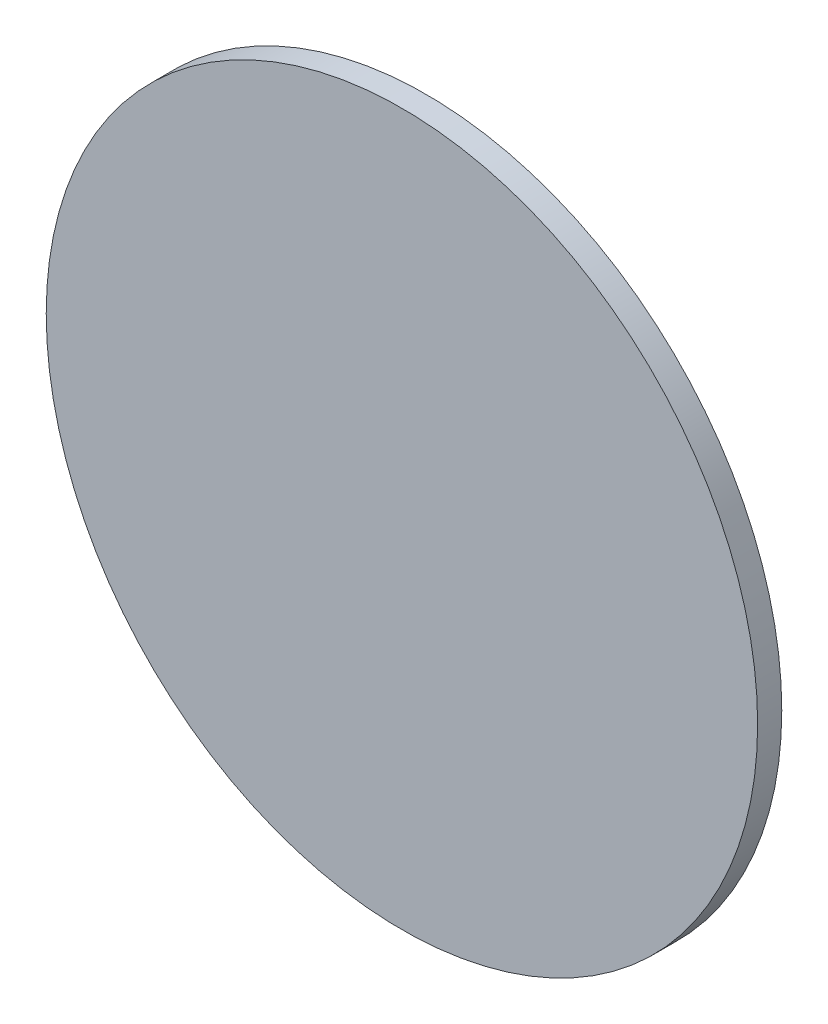
ISO-10303-21;
HEADER;
FILE_DESCRIPTION(('STEP AP214'),'2;1');
FILE_NAME('part.step','',(''),(''),'','','');
FILE_SCHEMA(('AUTOMOTIVE_DESIGN { 1 0 10303 214 1 1 1 1 }'));
ENDSEC;
DATA;
#1=APPLICATION_CONTEXT('core data for automotive mechanical design processes');
#2=APPLICATION_PROTOCOL_DEFINITION('international standard','automotive_design',2000,#1);
#3=PRODUCT_CONTEXT('',#1,'mechanical');
#4=PRODUCT('Part','Part','',(#3));
#5=PRODUCT_RELATED_PRODUCT_CATEGORY('part','',(#4));
#6=PRODUCT_DEFINITION_FORMATION('','',#4);
#7=PRODUCT_DEFINITION_CONTEXT('part definition',#1,'design');
#8=PRODUCT_DEFINITION('design','',#6,#7);
#9=PRODUCT_DEFINITION_SHAPE('','',#8);
#10=(LENGTH_UNIT() NAMED_UNIT(*) SI_UNIT(.MILLI.,.METRE.));
#11=(NAMED_UNIT(*) PLANE_ANGLE_UNIT() SI_UNIT($,.RADIAN.));
#12=(NAMED_UNIT(*) SI_UNIT($,.STERADIAN.) SOLID_ANGLE_UNIT());
#13=UNCERTAINTY_MEASURE_WITH_UNIT(LENGTH_MEASURE(1.E-05),#10,'distance_accuracy_value','');
#14=(GEOMETRIC_REPRESENTATION_CONTEXT(3) GLOBAL_UNCERTAINTY_ASSIGNED_CONTEXT((#13)) GLOBAL_UNIT_ASSIGNED_CONTEXT((#10,
#11,#12)) REPRESENTATION_CONTEXT('',''));
#15=CARTESIAN_POINT('',(0.,0.,0.));
#16=DIRECTION('',(0.,0.,1.));
#17=DIRECTION('',(1.,0.,0.));
#18=AXIS2_PLACEMENT_3D('',#15,#16,#17);
#19=CARTESIAN_POINT('',(0.,0.,10.));
#20=DIRECTION('',(0.,0.,-1.));
#21=DIRECTION('',(-1.,0.,0.));
#22=AXIS2_PLACEMENT_3D('',#19,#20,#21);
#23=CYLINDRICAL_SURFACE('',#22,147.418002466772);
#24=CARTESIAN_POINT('',(0.,0.,10.));
#25=DIRECTION('',(0.,0.,1.));
#26=DIRECTION('',(1.,0.,0.));
#27=AXIS2_PLACEMENT_3D('',#24,#25,#26);
#28=CIRCLE('',#27,147.418002466772);
#29=CARTESIAN_POINT('',(147.418002466772,0.,10.));
#30=VERTEX_POINT('',#29);
#31=EDGE_CURVE('E10',#30,#30,#28,.T.);
#32=ORIENTED_EDGE('',*,*,#31,.F.);
#33=EDGE_LOOP('',(#32));
#34=FACE_BOUND('',#33,.T.);
#35=CARTESIAN_POINT('',(0.,0.,0.));
#36=DIRECTION('',(0.,0.,1.));
#37=DIRECTION('',(1.,0.,0.));
#38=AXIS2_PLACEMENT_3D('',#35,#36,#37);
#39=CIRCLE('',#38,147.418002466772);
#40=CARTESIAN_POINT('',(147.418002466772,0.,0.));
#41=VERTEX_POINT('',#40);
#42=EDGE_CURVE('E34',#41,#41,#39,.T.);
#43=ORIENTED_EDGE('',*,*,#42,.T.);
#44=EDGE_LOOP('',(#43));
#45=FACE_BOUND('',#44,.T.);
#46=ADVANCED_FACE('F31',(#34,#45),#23,.T.);
#47=CARTESIAN_POINT('',(0.,0.,10.));
#48=DIRECTION('',(0.,0.,1.));
#49=DIRECTION('',(1.,0.,0.));
#50=AXIS2_PLACEMENT_3D('',#47,#48,#49);
#51=PLANE('',#50);
#52=ORIENTED_EDGE('',*,*,#31,.T.);
#53=EDGE_LOOP('',(#52));
#54=FACE_BOUND('',#53,.T.);
#55=ADVANCED_FACE('F46',(#54),#51,.T.);
#56=CARTESIAN_POINT('',(0.,0.,0.));
#57=DIRECTION('',(0.,0.,1.));
#58=DIRECTION('',(1.,0.,0.));
#59=AXIS2_PLACEMENT_3D('',#56,#57,#58);
#60=PLANE('',#59);
#61=ORIENTED_EDGE('',*,*,#42,.F.);
#62=EDGE_LOOP('',(#61));
#63=FACE_BOUND('',#62,.T.);
#64=ADVANCED_FACE('F44',(#63),#60,.F.);
#65=CLOSED_SHELL('',(#46,#55,#64));
#66=MANIFOLD_SOLID_BREP('B2',#65);
#67=ADVANCED_BREP_SHAPE_REPRESENTATION('',(#18,#66),#14);
#68=SHAPE_DEFINITION_REPRESENTATION(#9,#67);
ENDSEC;
END-ISO-10303-21;
